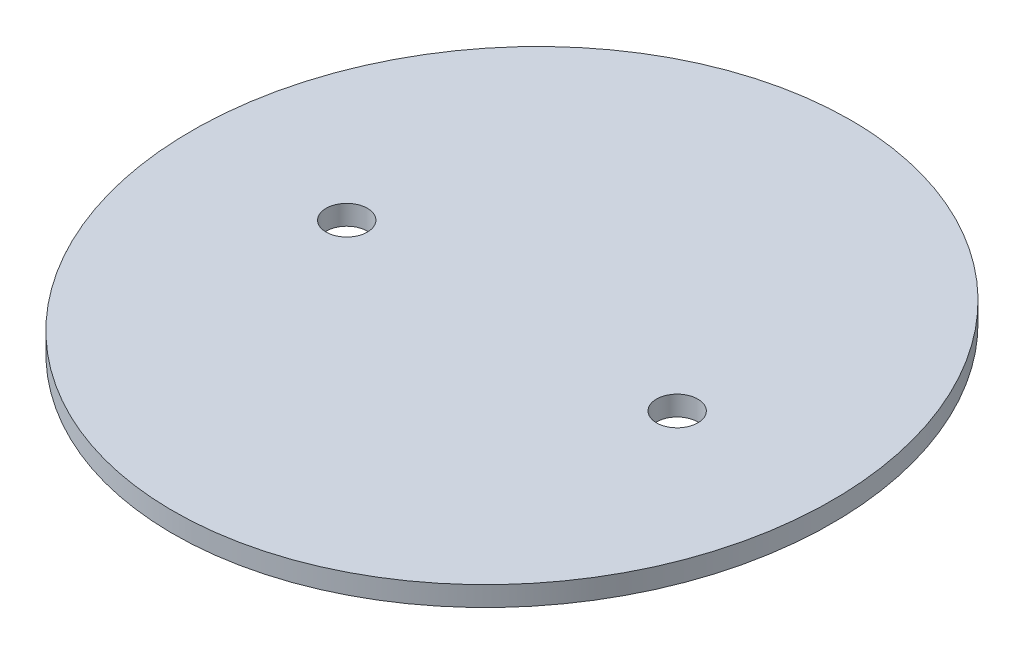
ISO-10303-21;
HEADER;
FILE_DESCRIPTION(('STEP AP214'),'2;1');
FILE_NAME('part.step','',(''),(''),'','','');
FILE_SCHEMA(('AUTOMOTIVE_DESIGN { 1 0 10303 214 1 1 1 1 }'));
ENDSEC;
DATA;
#1=APPLICATION_CONTEXT('core data for automotive mechanical design processes');
#2=APPLICATION_PROTOCOL_DEFINITION('international standard','automotive_design',2000,#1);
#3=PRODUCT_CONTEXT('',#1,'mechanical');
#4=PRODUCT('Part','Part','',(#3));
#5=PRODUCT_RELATED_PRODUCT_CATEGORY('part','',(#4));
#6=PRODUCT_DEFINITION_FORMATION('','',#4);
#7=PRODUCT_DEFINITION_CONTEXT('part definition',#1,'design');
#8=PRODUCT_DEFINITION('design','',#6,#7);
#9=PRODUCT_DEFINITION_SHAPE('','',#8);
#10=(LENGTH_UNIT() NAMED_UNIT(*) SI_UNIT(.MILLI.,.METRE.));
#11=(NAMED_UNIT(*) PLANE_ANGLE_UNIT() SI_UNIT($,.RADIAN.));
#12=(NAMED_UNIT(*) SI_UNIT($,.STERADIAN.) SOLID_ANGLE_UNIT());
#13=UNCERTAINTY_MEASURE_WITH_UNIT(LENGTH_MEASURE(1.E-05),#10,'distance_accuracy_value','');
#14=(GEOMETRIC_REPRESENTATION_CONTEXT(3) GLOBAL_UNCERTAINTY_ASSIGNED_CONTEXT((#13)) GLOBAL_UNIT_ASSIGNED_CONTEXT((#10,
#11,#12)) REPRESENTATION_CONTEXT('',''));
#15=CARTESIAN_POINT('',(0.,0.,0.));
#16=DIRECTION('',(0.,0.,1.));
#17=DIRECTION('',(1.,0.,0.));
#18=AXIS2_PLACEMENT_3D('',#15,#16,#17);
#19=CARTESIAN_POINT('',(0.,6.,0.));
#20=DIRECTION('',(0.,1.,0.));
#21=DIRECTION('',(0.,0.,1.));
#22=AXIS2_PLACEMENT_3D('',#19,#20,#21);
#23=PLANE('',#22);
#24=CARTESIAN_POINT('',(-50.,6.,0.));
#25=DIRECTION('',(0.,1.,0.));
#26=DIRECTION('',(0.,0.,1.));
#27=AXIS2_PLACEMENT_3D('',#24,#25,#26);
#28=CIRCLE('',#27,6.25);
#29=CARTESIAN_POINT('',(-50.,6.,6.25));
#30=VERTEX_POINT('',#29);
#31=EDGE_CURVE('E42',#30,#30,#28,.T.);
#32=ORIENTED_EDGE('',*,*,#31,.F.);
#33=EDGE_LOOP('',(#32));
#34=FACE_BOUND('',#33,.T.);
#35=CARTESIAN_POINT('',(0.,6.,0.));
#36=DIRECTION('',(0.,1.,0.));
#37=DIRECTION('',(0.,0.,-1.));
#38=AXIS2_PLACEMENT_3D('',#35,#36,#37);
#39=ELLIPSE('',#38,102.5,96.9);
#40=CARTESIAN_POINT('',(0.,6.,-102.5));
#41=VERTEX_POINT('',#40);
#42=EDGE_CURVE('E10',#41,#41,#39,.T.);
#43=ORIENTED_EDGE('',*,*,#42,.T.);
#44=EDGE_LOOP('',(#43));
#45=FACE_BOUND('',#44,.T.);
#46=CARTESIAN_POINT('',(50.,6.,0.));
#47=DIRECTION('',(0.,1.,0.));
#48=DIRECTION('',(0.,0.,1.));
#49=AXIS2_PLACEMENT_3D('',#46,#47,#48);
#50=CIRCLE('',#49,6.25000000000001);
#51=CARTESIAN_POINT('',(50.,6.,6.25000000000001));
#52=VERTEX_POINT('',#51);
#53=EDGE_CURVE('E48',#52,#52,#50,.T.);
#54=ORIENTED_EDGE('',*,*,#53,.F.);
#55=EDGE_LOOP('',(#54));
#56=FACE_BOUND('',#55,.T.);
#57=ADVANCED_FACE('F31',(#34,#45,#56),#23,.T.);
#58=CARTESIAN_POINT('',(0.,0.,0.));
#59=DIRECTION('',(0.,1.,0.));
#60=DIRECTION('',(0.,0.,1.));
#61=AXIS2_PLACEMENT_3D('',#58,#59,#60);
#62=PLANE('',#61);
#63=CARTESIAN_POINT('',(-50.,0.,0.));
#64=DIRECTION('',(0.,1.,0.));
#65=DIRECTION('',(0.,0.,1.));
#66=AXIS2_PLACEMENT_3D('',#63,#64,#65);
#67=CIRCLE('',#66,6.25);
#68=CARTESIAN_POINT('',(-50.,0.,6.25));
#69=VERTEX_POINT('',#68);
#70=EDGE_CURVE('E45',#69,#69,#67,.T.);
#71=ORIENTED_EDGE('',*,*,#70,.T.);
#72=EDGE_LOOP('',(#71));
#73=FACE_BOUND('',#72,.T.);
#74=CARTESIAN_POINT('',(0.,0.,0.));
#75=DIRECTION('',(0.,1.,0.));
#76=DIRECTION('',(0.,0.,-1.));
#77=AXIS2_PLACEMENT_3D('',#74,#75,#76);
#78=ELLIPSE('',#77,102.5,96.9);
#79=CARTESIAN_POINT('',(0.,0.,-102.5));
#80=VERTEX_POINT('',#79);
#81=EDGE_CURVE('E36',#80,#80,#78,.T.);
#82=ORIENTED_EDGE('',*,*,#81,.F.);
#83=EDGE_LOOP('',(#82));
#84=FACE_BOUND('',#83,.T.);
#85=CARTESIAN_POINT('',(50.,0.,0.));
#86=DIRECTION('',(0.,1.,0.));
#87=DIRECTION('',(0.,0.,1.));
#88=AXIS2_PLACEMENT_3D('',#85,#86,#87);
#89=CIRCLE('',#88,6.25000000000001);
#90=CARTESIAN_POINT('',(50.,0.,6.25000000000001));
#91=VERTEX_POINT('',#90);
#92=EDGE_CURVE('E51',#91,#91,#89,.T.);
#93=ORIENTED_EDGE('',*,*,#92,.T.);
#94=EDGE_LOOP('',(#93));
#95=FACE_BOUND('',#94,.T.);
#96=ADVANCED_FACE('F61',(#73,#84,#95),#62,.F.);
#97=DIRECTION('',(0.,-1.,0.));
#98=VECTOR('',#97,1.);
#99=SURFACE_OF_LINEAR_EXTRUSION('',#39,#98);
#100=ORIENTED_EDGE('',*,*,#42,.F.);
#101=EDGE_LOOP('',(#100));
#102=FACE_BOUND('',#101,.T.);
#103=ORIENTED_EDGE('',*,*,#81,.T.);
#104=EDGE_LOOP('',(#103));
#105=FACE_BOUND('',#104,.T.);
#106=ADVANCED_FACE('F33',(#102,#105),#99,.F.);
#107=CARTESIAN_POINT('',(-50.,6.,0.));
#108=DIRECTION('',(0.,-1.,0.));
#109=DIRECTION('',(0.,0.,-1.));
#110=AXIS2_PLACEMENT_3D('',#107,#108,#109);
#111=CYLINDRICAL_SURFACE('',#110,6.25);
#112=ORIENTED_EDGE('',*,*,#31,.T.);
#113=EDGE_LOOP('',(#112));
#114=FACE_BOUND('',#113,.T.);
#115=ORIENTED_EDGE('',*,*,#70,.F.);
#116=EDGE_LOOP('',(#115));
#117=FACE_BOUND('',#116,.T.);
#118=ADVANCED_FACE('F70',(#114,#117),#111,.F.);
#119=CARTESIAN_POINT('',(50.,6.,0.));
#120=DIRECTION('',(0.,-1.,0.));
#121=DIRECTION('',(0.,0.,-1.));
#122=AXIS2_PLACEMENT_3D('',#119,#120,#121);
#123=CYLINDRICAL_SURFACE('',#122,6.25000000000001);
#124=ORIENTED_EDGE('',*,*,#53,.T.);
#125=EDGE_LOOP('',(#124));
#126=FACE_BOUND('',#125,.T.);
#127=ORIENTED_EDGE('',*,*,#92,.F.);
#128=EDGE_LOOP('',(#127));
#129=FACE_BOUND('',#128,.T.);
#130=ADVANCED_FACE('F57',(#126,#129),#123,.F.);
#131=CLOSED_SHELL('',(#57,#96,#106,#118,#130));
#132=MANIFOLD_SOLID_BREP('B2',#131);
#133=ADVANCED_BREP_SHAPE_REPRESENTATION('',(#18,#132),#14);
#134=SHAPE_DEFINITION_REPRESENTATION(#9,#133);
ENDSEC;
END-ISO-10303-21;
